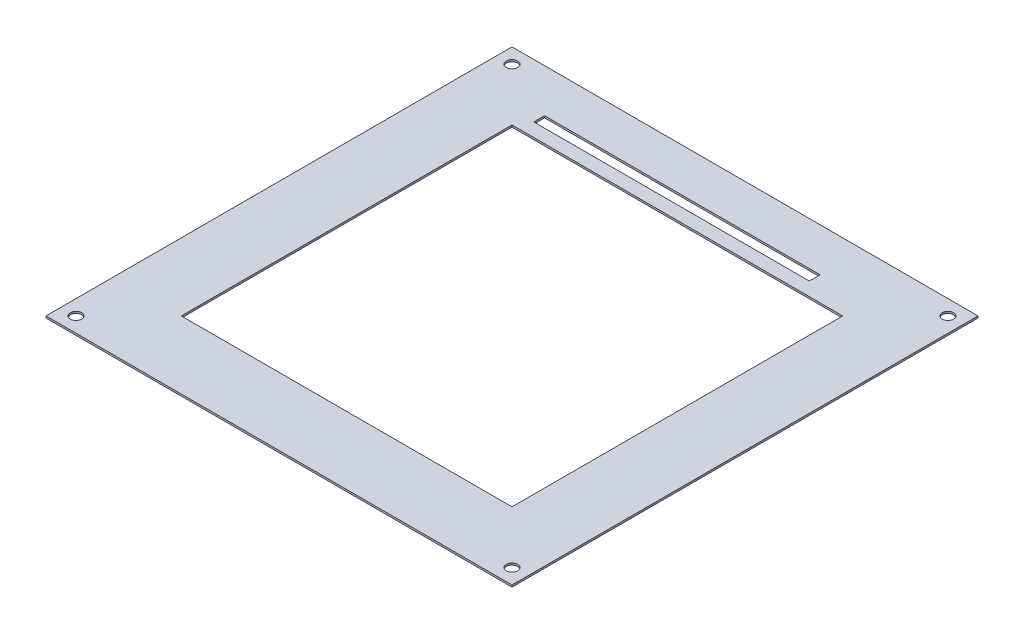
ISO-10303-21;
HEADER;
FILE_DESCRIPTION(('STEP AP214'),'2;1');
FILE_NAME('part.step','',(''),(''),'','','');
FILE_SCHEMA(('AUTOMOTIVE_DESIGN { 1 0 10303 214 1 1 1 1 }'));
ENDSEC;
DATA;
#1=APPLICATION_CONTEXT('core data for automotive mechanical design processes');
#2=APPLICATION_PROTOCOL_DEFINITION('international standard','automotive_design',2000,#1);
#3=PRODUCT_CONTEXT('',#1,'mechanical');
#4=PRODUCT('Part','Part','',(#3));
#5=PRODUCT_RELATED_PRODUCT_CATEGORY('part','',(#4));
#6=PRODUCT_DEFINITION_FORMATION('','',#4);
#7=PRODUCT_DEFINITION_CONTEXT('part definition',#1,'design');
#8=PRODUCT_DEFINITION('design','',#6,#7);
#9=PRODUCT_DEFINITION_SHAPE('','',#8);
#10=(LENGTH_UNIT() NAMED_UNIT(*) SI_UNIT(.MILLI.,.METRE.));
#11=(NAMED_UNIT(*) PLANE_ANGLE_UNIT() SI_UNIT($,.RADIAN.));
#12=(NAMED_UNIT(*) SI_UNIT($,.STERADIAN.) SOLID_ANGLE_UNIT());
#13=UNCERTAINTY_MEASURE_WITH_UNIT(LENGTH_MEASURE(1.E-05),#10,'distance_accuracy_value','');
#14=(GEOMETRIC_REPRESENTATION_CONTEXT(3) GLOBAL_UNCERTAINTY_ASSIGNED_CONTEXT((#13)) GLOBAL_UNIT_ASSIGNED_CONTEXT((#10,
#11,#12)) REPRESENTATION_CONTEXT('',''));
#15=CARTESIAN_POINT('',(0.,0.,0.));
#16=DIRECTION('',(0.,0.,1.));
#17=DIRECTION('',(1.,0.,0.));
#18=AXIS2_PLACEMENT_3D('',#15,#16,#17);
#19=CARTESIAN_POINT('',(0.,0.5,0.));
#20=DIRECTION('',(0.,-1.,0.));
#21=DIRECTION('',(0.,0.,-1.));
#22=AXIS2_PLACEMENT_3D('',#19,#20,#21);
#23=PLANE('',#22);
#24=CARTESIAN_POINT('',(120.,0.5,-4.));
#25=DIRECTION('',(0.,1.,0.));
#26=DIRECTION('',(0.,0.,1.));
#27=AXIS2_PLACEMENT_3D('',#24,#25,#26);
#28=CIRCLE('',#27,1.5);
#29=CARTESIAN_POINT('',(120.,0.5,-2.5));
#30=VERTEX_POINT('',#29);
#31=EDGE_CURVE('E332',#30,#30,#28,.T.);
#32=ORIENTED_EDGE('',*,*,#31,.F.);
#33=EDGE_LOOP('',(#32));
#34=FACE_BOUND('',#33,.T.);
#35=CARTESIAN_POINT('',(4.,0.5,-120.));
#36=DIRECTION('',(0.,1.,0.));
#37=DIRECTION('',(0.,0.,1.));
#38=AXIS2_PLACEMENT_3D('',#35,#36,#37);
#39=CIRCLE('',#38,1.5);
#40=CARTESIAN_POINT('',(4.,0.5,-118.5));
#41=VERTEX_POINT('',#40);
#42=EDGE_CURVE('E155',#41,#41,#39,.T.);
#43=ORIENTED_EDGE('',*,*,#42,.F.);
#44=EDGE_LOOP('',(#43));
#45=FACE_BOUND('',#44,.T.);
#46=DIRECTION('',(0.,0.,1.));
#47=VECTOR('',#46,1.);
#48=CARTESIAN_POINT('',(18.,0.5,-106.));
#49=LINE('',#48,#47);
#50=CARTESIAN_POINT('',(18.,0.5,-106.));
#51=VERTEX_POINT('',#50);
#52=CARTESIAN_POINT('',(18.,0.5,-18.));
#53=VERTEX_POINT('',#52);
#54=EDGE_CURVE('E165',#51,#53,#49,.T.);
#55=ORIENTED_EDGE('',*,*,#54,.F.);
#56=DIRECTION('',(-1.,0.,0.));
#57=VECTOR('',#56,1.);
#58=CARTESIAN_POINT('',(18.,0.5,-106.));
#59=LINE('',#58,#57);
#60=CARTESIAN_POINT('',(106.,0.5,-106.));
#61=VERTEX_POINT('',#60);
#62=EDGE_CURVE('E173',#61,#51,#59,.T.);
#63=ORIENTED_EDGE('',*,*,#62,.F.);
#64=DIRECTION('',(0.,0.,-1.));
#65=VECTOR('',#64,1.);
#66=CARTESIAN_POINT('',(106.,0.5,-106.));
#67=LINE('',#66,#65);
#68=CARTESIAN_POINT('',(106.,0.5,-18.));
#69=VERTEX_POINT('',#68);
#70=EDGE_CURVE('E170',#69,#61,#67,.T.);
#71=ORIENTED_EDGE('',*,*,#70,.F.);
#72=DIRECTION('',(1.,0.,0.));
#73=VECTOR('',#72,1.);
#74=CARTESIAN_POINT('',(18.,0.5,-18.));
#75=LINE('',#74,#73);
#76=EDGE_CURVE('E167',#53,#69,#75,.T.);
#77=ORIENTED_EDGE('',*,*,#76,.F.);
#78=EDGE_LOOP('',(#55,#63,#71,#77));
#79=FACE_BOUND('',#78,.T.);
#80=DIRECTION('',(0.,0.,1.));
#81=VECTOR('',#80,1.);
#82=CARTESIAN_POINT('',(0.,0.5,0.));
#83=LINE('',#82,#81);
#84=CARTESIAN_POINT('',(0.,0.5,-124.));
#85=VERTEX_POINT('',#84);
#86=CARTESIAN_POINT('',(0.,0.5,0.));
#87=VERTEX_POINT('',#86);
#88=EDGE_CURVE('E196',#85,#87,#83,.T.);
#89=ORIENTED_EDGE('',*,*,#88,.T.);
#90=DIRECTION('',(1.,0.,0.));
#91=VECTOR('',#90,1.);
#92=CARTESIAN_POINT('',(0.,0.5,0.));
#93=LINE('',#92,#91);
#94=CARTESIAN_POINT('',(124.,0.5,0.));
#95=VERTEX_POINT('',#94);
#96=EDGE_CURVE('E199',#87,#95,#93,.T.);
#97=ORIENTED_EDGE('',*,*,#96,.T.);
#98=DIRECTION('',(0.,0.,-1.));
#99=VECTOR('',#98,1.);
#100=CARTESIAN_POINT('',(124.,0.5,0.));
#101=LINE('',#100,#99);
#102=CARTESIAN_POINT('',(124.,0.5,-124.));
#103=VERTEX_POINT('',#102);
#104=EDGE_CURVE('E202',#95,#103,#101,.T.);
#105=ORIENTED_EDGE('',*,*,#104,.T.);
#106=DIRECTION('',(-1.,0.,0.));
#107=VECTOR('',#106,1.);
#108=CARTESIAN_POINT('',(0.,0.5,-124.));
#109=LINE('',#108,#107);
#110=EDGE_CURVE('E204',#103,#85,#109,.T.);
#111=ORIENTED_EDGE('',*,*,#110,.T.);
#112=EDGE_LOOP('',(#89,#97,#105,#111));
#113=FACE_BOUND('',#112,.T.);
#114=DIRECTION('',(0.,0.,1.));
#115=VECTOR('',#114,1.);
#116=CARTESIAN_POINT('',(20.1898829633925,0.5,-112.467326066186));
#117=LINE('',#116,#115);
#118=CARTESIAN_POINT('',(20.1898829633925,0.5,-112.467326066186));
#119=VERTEX_POINT('',#118);
#120=CARTESIAN_POINT('',(20.1898829633925,0.5,-109.596676405698));
#121=VERTEX_POINT('',#120);
#122=EDGE_CURVE('E126',#119,#121,#117,.T.);
#123=ORIENTED_EDGE('',*,*,#122,.F.);
#124=DIRECTION('',(-1.,0.,0.));
#125=VECTOR('',#124,1.);
#126=CARTESIAN_POINT('',(20.1898829633925,0.5,-112.467326066186));
#127=LINE('',#126,#125);
#128=CARTESIAN_POINT('',(93.5219333813082,0.5,-112.467326066186));
#129=VERTEX_POINT('',#128);
#130=EDGE_CURVE('E149',#129,#119,#127,.T.);
#131=ORIENTED_EDGE('',*,*,#130,.F.);
#132=DIRECTION('',(0.,0.,-1.));
#133=VECTOR('',#132,1.);
#134=CARTESIAN_POINT('',(93.5219333813082,0.5,-112.467326066186));
#135=LINE('',#134,#133);
#136=CARTESIAN_POINT('',(93.5219333813082,0.5,-109.596676405698));
#137=VERTEX_POINT('',#136);
#138=EDGE_CURVE('E147',#137,#129,#135,.T.);
#139=ORIENTED_EDGE('',*,*,#138,.F.);
#140=DIRECTION('',(1.,0.,0.));
#141=VECTOR('',#140,1.);
#142=CARTESIAN_POINT('',(20.1898829633925,0.5,-109.596676405698));
#143=LINE('',#142,#141);
#144=EDGE_CURVE('E134',#121,#137,#143,.T.);
#145=ORIENTED_EDGE('',*,*,#144,.F.);
#146=EDGE_LOOP('',(#123,#131,#139,#145));
#147=FACE_BOUND('',#146,.T.);
#148=CARTESIAN_POINT('',(120.,0.5,-120.));
#149=DIRECTION('',(0.,1.,0.));
#150=DIRECTION('',(0.,0.,1.));
#151=AXIS2_PLACEMENT_3D('',#148,#149,#150);
#152=CIRCLE('',#151,1.5);
#153=CARTESIAN_POINT('',(120.,0.5,-118.5));
#154=VERTEX_POINT('',#153);
#155=EDGE_CURVE('E338',#154,#154,#152,.T.);
#156=ORIENTED_EDGE('',*,*,#155,.F.);
#157=EDGE_LOOP('',(#156));
#158=FACE_BOUND('',#157,.T.);
#159=CARTESIAN_POINT('',(4.,0.5,-4.));
#160=DIRECTION('',(0.,1.,0.));
#161=DIRECTION('',(0.,0.,1.));
#162=AXIS2_PLACEMENT_3D('',#159,#160,#161);
#163=CIRCLE('',#162,1.5);
#164=CARTESIAN_POINT('',(4.,0.5,-2.5));
#165=VERTEX_POINT('',#164);
#166=EDGE_CURVE('E323',#165,#165,#163,.T.);
#167=ORIENTED_EDGE('',*,*,#166,.F.);
#168=EDGE_LOOP('',(#167));
#169=FACE_BOUND('',#168,.T.);
#170=ADVANCED_FACE('F37',(#34,#45,#79,#113,#147,#158,#169),#23,.F.);
#171=CARTESIAN_POINT('',(0.,0.,0.));
#172=DIRECTION('',(0.,-1.,0.));
#173=DIRECTION('',(0.,0.,-1.));
#174=AXIS2_PLACEMENT_3D('',#171,#172,#173);
#175=PLANE('',#174);
#176=CARTESIAN_POINT('',(120.,0.,-4.));
#177=DIRECTION('',(0.,1.,0.));
#178=DIRECTION('',(0.,0.,1.));
#179=AXIS2_PLACEMENT_3D('',#176,#177,#178);
#180=CIRCLE('',#179,1.5);
#181=CARTESIAN_POINT('',(120.,0.,-2.5));
#182=VERTEX_POINT('',#181);
#183=EDGE_CURVE('E329',#182,#182,#180,.T.);
#184=ORIENTED_EDGE('',*,*,#183,.T.);
#185=EDGE_LOOP('',(#184));
#186=FACE_BOUND('',#185,.T.);
#187=CARTESIAN_POINT('',(4.,0.,-120.));
#188=DIRECTION('',(0.,1.,0.));
#189=DIRECTION('',(0.,0.,1.));
#190=AXIS2_PLACEMENT_3D('',#187,#188,#189);
#191=CIRCLE('',#190,1.5);
#192=CARTESIAN_POINT('',(4.,0.,-118.5));
#193=VERTEX_POINT('',#192);
#194=EDGE_CURVE('E341',#193,#193,#191,.T.);
#195=ORIENTED_EDGE('',*,*,#194,.T.);
#196=EDGE_LOOP('',(#195));
#197=FACE_BOUND('',#196,.T.);
#198=DIRECTION('',(-1.,0.,0.));
#199=VECTOR('',#198,1.);
#200=CARTESIAN_POINT('',(18.,0.,-106.));
#201=LINE('',#200,#199);
#202=CARTESIAN_POINT('',(106.,0.,-106.));
#203=VERTEX_POINT('',#202);
#204=CARTESIAN_POINT('',(18.,0.,-106.));
#205=VERTEX_POINT('',#204);
#206=EDGE_CURVE('E168',#203,#205,#201,.T.);
#207=ORIENTED_EDGE('',*,*,#206,.T.);
#208=DIRECTION('',(0.,0.,1.));
#209=VECTOR('',#208,1.);
#210=CARTESIAN_POINT('',(18.,0.,-106.));
#211=LINE('',#210,#209);
#212=CARTESIAN_POINT('',(18.,0.,-18.));
#213=VERTEX_POINT('',#212);
#214=EDGE_CURVE('E142',#205,#213,#211,.T.);
#215=ORIENTED_EDGE('',*,*,#214,.T.);
#216=DIRECTION('',(1.,0.,0.));
#217=VECTOR('',#216,1.);
#218=CARTESIAN_POINT('',(18.,0.,-18.));
#219=LINE('',#218,#217);
#220=CARTESIAN_POINT('',(106.,0.,-18.));
#221=VERTEX_POINT('',#220);
#222=EDGE_CURVE('E178',#213,#221,#219,.T.);
#223=ORIENTED_EDGE('',*,*,#222,.T.);
#224=DIRECTION('',(0.,0.,-1.));
#225=VECTOR('',#224,1.);
#226=CARTESIAN_POINT('',(106.,0.,-106.));
#227=LINE('',#226,#225);
#228=EDGE_CURVE('E181',#221,#203,#227,.T.);
#229=ORIENTED_EDGE('',*,*,#228,.T.);
#230=EDGE_LOOP('',(#207,#215,#223,#229));
#231=FACE_BOUND('',#230,.T.);
#232=DIRECTION('',(0.,0.,1.));
#233=VECTOR('',#232,1.);
#234=CARTESIAN_POINT('',(0.,0.,0.));
#235=LINE('',#234,#233);
#236=CARTESIAN_POINT('',(0.,0.,-124.));
#237=VERTEX_POINT('',#236);
#238=CARTESIAN_POINT('',(0.,0.,0.));
#239=VERTEX_POINT('',#238);
#240=EDGE_CURVE('E195',#237,#239,#235,.T.);
#241=ORIENTED_EDGE('',*,*,#240,.F.);
#242=DIRECTION('',(-1.,0.,0.));
#243=VECTOR('',#242,1.);
#244=CARTESIAN_POINT('',(0.,0.,-124.));
#245=LINE('',#244,#243);
#246=CARTESIAN_POINT('',(124.,0.,-124.));
#247=VERTEX_POINT('',#246);
#248=EDGE_CURVE('E200',#247,#237,#245,.T.);
#249=ORIENTED_EDGE('',*,*,#248,.F.);
#250=DIRECTION('',(0.,0.,-1.));
#251=VECTOR('',#250,1.);
#252=CARTESIAN_POINT('',(124.,0.,0.));
#253=LINE('',#252,#251);
#254=CARTESIAN_POINT('',(124.,0.,0.));
#255=VERTEX_POINT('',#254);
#256=EDGE_CURVE('E211',#255,#247,#253,.T.);
#257=ORIENTED_EDGE('',*,*,#256,.F.);
#258=DIRECTION('',(1.,0.,0.));
#259=VECTOR('',#258,1.);
#260=CARTESIAN_POINT('',(0.,0.,0.));
#261=LINE('',#260,#259);
#262=EDGE_CURVE('E209',#239,#255,#261,.T.);
#263=ORIENTED_EDGE('',*,*,#262,.F.);
#264=EDGE_LOOP('',(#241,#249,#257,#263));
#265=FACE_BOUND('',#264,.T.);
#266=DIRECTION('',(-1.,0.,0.));
#267=VECTOR('',#266,1.);
#268=CARTESIAN_POINT('',(20.1898829633925,0.,-112.467326066186));
#269=LINE('',#268,#267);
#270=CARTESIAN_POINT('',(93.5219333813082,0.,-112.467326066186));
#271=VERTEX_POINT('',#270);
#272=CARTESIAN_POINT('',(20.1898829633925,0.,-112.467326066186));
#273=VERTEX_POINT('',#272);
#274=EDGE_CURVE('E135',#271,#273,#269,.T.);
#275=ORIENTED_EDGE('',*,*,#274,.T.);
#276=DIRECTION('',(0.,0.,1.));
#277=VECTOR('',#276,1.);
#278=CARTESIAN_POINT('',(20.1898829633925,0.,-112.467326066186));
#279=LINE('',#278,#277);
#280=CARTESIAN_POINT('',(20.1898829633925,0.,-109.596676405698));
#281=VERTEX_POINT('',#280);
#282=EDGE_CURVE('E60',#273,#281,#279,.T.);
#283=ORIENTED_EDGE('',*,*,#282,.T.);
#284=DIRECTION('',(1.,0.,0.));
#285=VECTOR('',#284,1.);
#286=CARTESIAN_POINT('',(20.1898829633925,0.,-109.596676405698));
#287=LINE('',#286,#285);
#288=CARTESIAN_POINT('',(93.5219333813082,0.,-109.596676405698));
#289=VERTEX_POINT('',#288);
#290=EDGE_CURVE('E141',#281,#289,#287,.T.);
#291=ORIENTED_EDGE('',*,*,#290,.T.);
#292=DIRECTION('',(0.,0.,-1.));
#293=VECTOR('',#292,1.);
#294=CARTESIAN_POINT('',(93.5219333813082,0.,-112.467326066186));
#295=LINE('',#294,#293);
#296=EDGE_CURVE('E157',#289,#271,#295,.T.);
#297=ORIENTED_EDGE('',*,*,#296,.T.);
#298=EDGE_LOOP('',(#275,#283,#291,#297));
#299=FACE_BOUND('',#298,.T.);
#300=CARTESIAN_POINT('',(120.,0.,-120.));
#301=DIRECTION('',(0.,1.,0.));
#302=DIRECTION('',(0.,0.,1.));
#303=AXIS2_PLACEMENT_3D('',#300,#301,#302);
#304=CIRCLE('',#303,1.5);
#305=CARTESIAN_POINT('',(120.,0.,-118.5));
#306=VERTEX_POINT('',#305);
#307=EDGE_CURVE('E335',#306,#306,#304,.T.);
#308=ORIENTED_EDGE('',*,*,#307,.T.);
#309=EDGE_LOOP('',(#308));
#310=FACE_BOUND('',#309,.T.);
#311=CARTESIAN_POINT('',(4.,0.,-4.));
#312=DIRECTION('',(0.,1.,0.));
#313=DIRECTION('',(0.,0.,1.));
#314=AXIS2_PLACEMENT_3D('',#311,#312,#313);
#315=CIRCLE('',#314,1.5);
#316=CARTESIAN_POINT('',(4.,0.,-2.5));
#317=VERTEX_POINT('',#316);
#318=EDGE_CURVE('E326',#317,#317,#315,.T.);
#319=ORIENTED_EDGE('',*,*,#318,.T.);
#320=EDGE_LOOP('',(#319));
#321=FACE_BOUND('',#320,.T.);
#322=ADVANCED_FACE('F229',(#186,#197,#231,#265,#299,#310,#321),#175,.T.);
#323=CARTESIAN_POINT('',(0.,0.5,0.));
#324=DIRECTION('',(1.,0.,0.));
#325=DIRECTION('',(0.,0.,-1.));
#326=AXIS2_PLACEMENT_3D('',#323,#324,#325);
#327=PLANE('',#326);
#328=ORIENTED_EDGE('',*,*,#240,.T.);
#329=DIRECTION('',(0.,-1.,0.));
#330=VECTOR('',#329,1.);
#331=CARTESIAN_POINT('',(0.,0.5,0.));
#332=LINE('',#331,#330);
#333=EDGE_CURVE('E11',#87,#239,#332,.T.);
#334=ORIENTED_EDGE('',*,*,#333,.F.);
#335=ORIENTED_EDGE('',*,*,#88,.F.);
#336=DIRECTION('',(0.,-1.,0.));
#337=VECTOR('',#336,1.);
#338=CARTESIAN_POINT('',(0.,0.5,-124.));
#339=LINE('',#338,#337);
#340=EDGE_CURVE('E206',#85,#237,#339,.T.);
#341=ORIENTED_EDGE('',*,*,#340,.T.);
#342=EDGE_LOOP('',(#328,#334,#335,#341));
#343=FACE_BOUND('',#342,.T.);
#344=ADVANCED_FACE('F39',(#343),#327,.F.);
#345=CARTESIAN_POINT('',(0.,0.5,0.));
#346=DIRECTION('',(0.,0.,-1.));
#347=DIRECTION('',(-1.,0.,0.));
#348=AXIS2_PLACEMENT_3D('',#345,#346,#347);
#349=PLANE('',#348);
#350=ORIENTED_EDGE('',*,*,#262,.T.);
#351=DIRECTION('',(0.,-1.,0.));
#352=VECTOR('',#351,1.);
#353=CARTESIAN_POINT('',(124.,0.5,0.));
#354=LINE('',#353,#352);
#355=EDGE_CURVE('E45',#95,#255,#354,.T.);
#356=ORIENTED_EDGE('',*,*,#355,.F.);
#357=ORIENTED_EDGE('',*,*,#96,.F.);
#358=ORIENTED_EDGE('',*,*,#333,.T.);
#359=EDGE_LOOP('',(#350,#356,#357,#358));
#360=FACE_BOUND('',#359,.T.);
#361=ADVANCED_FACE('F239',(#360),#349,.F.);
#362=CARTESIAN_POINT('',(124.,0.5,0.));
#363=DIRECTION('',(-1.,0.,0.));
#364=DIRECTION('',(0.,0.,1.));
#365=AXIS2_PLACEMENT_3D('',#362,#363,#364);
#366=PLANE('',#365);
#367=ORIENTED_EDGE('',*,*,#256,.T.);
#368=DIRECTION('',(0.,-1.,0.));
#369=VECTOR('',#368,1.);
#370=CARTESIAN_POINT('',(124.,0.5,-124.));
#371=LINE('',#370,#369);
#372=EDGE_CURVE('E216',#103,#247,#371,.T.);
#373=ORIENTED_EDGE('',*,*,#372,.F.);
#374=ORIENTED_EDGE('',*,*,#104,.F.);
#375=ORIENTED_EDGE('',*,*,#355,.T.);
#376=EDGE_LOOP('',(#367,#373,#374,#375));
#377=FACE_BOUND('',#376,.T.);
#378=ADVANCED_FACE('F223',(#377),#366,.F.);
#379=CARTESIAN_POINT('',(0.,0.5,-124.));
#380=DIRECTION('',(0.,0.,1.));
#381=DIRECTION('',(1.,0.,0.));
#382=AXIS2_PLACEMENT_3D('',#379,#380,#381);
#383=PLANE('',#382);
#384=ORIENTED_EDGE('',*,*,#248,.T.);
#385=ORIENTED_EDGE('',*,*,#340,.F.);
#386=ORIENTED_EDGE('',*,*,#110,.F.);
#387=ORIENTED_EDGE('',*,*,#372,.T.);
#388=EDGE_LOOP('',(#384,#385,#386,#387));
#389=FACE_BOUND('',#388,.T.);
#390=ADVANCED_FACE('F233',(#389),#383,.F.);
#391=CARTESIAN_POINT('',(18.,0.5,-106.));
#392=DIRECTION('',(1.,0.,0.));
#393=DIRECTION('',(0.,0.,-1.));
#394=AXIS2_PLACEMENT_3D('',#391,#392,#393);
#395=PLANE('',#394);
#396=ORIENTED_EDGE('',*,*,#214,.F.);
#397=DIRECTION('',(0.,-1.,0.));
#398=VECTOR('',#397,1.);
#399=CARTESIAN_POINT('',(18.,0.5,-106.));
#400=LINE('',#399,#398);
#401=EDGE_CURVE('E175',#51,#205,#400,.T.);
#402=ORIENTED_EDGE('',*,*,#401,.F.);
#403=ORIENTED_EDGE('',*,*,#54,.T.);
#404=DIRECTION('',(0.,-1.,0.));
#405=VECTOR('',#404,1.);
#406=CARTESIAN_POINT('',(18.,0.5,-18.));
#407=LINE('',#406,#405);
#408=EDGE_CURVE('E192',#53,#213,#407,.T.);
#409=ORIENTED_EDGE('',*,*,#408,.T.);
#410=EDGE_LOOP('',(#396,#402,#403,#409));
#411=FACE_BOUND('',#410,.T.);
#412=ADVANCED_FACE('F257',(#411),#395,.T.);
#413=CARTESIAN_POINT('',(18.,0.5,-18.));
#414=DIRECTION('',(0.,0.,-1.));
#415=DIRECTION('',(-1.,0.,0.));
#416=AXIS2_PLACEMENT_3D('',#413,#414,#415);
#417=PLANE('',#416);
#418=ORIENTED_EDGE('',*,*,#222,.F.);
#419=ORIENTED_EDGE('',*,*,#408,.F.);
#420=ORIENTED_EDGE('',*,*,#76,.T.);
#421=DIRECTION('',(0.,-1.,0.));
#422=VECTOR('',#421,1.);
#423=CARTESIAN_POINT('',(106.,0.5,-18.));
#424=LINE('',#423,#422);
#425=EDGE_CURVE('E190',#69,#221,#424,.T.);
#426=ORIENTED_EDGE('',*,*,#425,.T.);
#427=EDGE_LOOP('',(#418,#419,#420,#426));
#428=FACE_BOUND('',#427,.T.);
#429=ADVANCED_FACE('F264',(#428),#417,.T.);
#430=CARTESIAN_POINT('',(106.,0.5,-106.));
#431=DIRECTION('',(-1.,0.,0.));
#432=DIRECTION('',(0.,0.,1.));
#433=AXIS2_PLACEMENT_3D('',#430,#431,#432);
#434=PLANE('',#433);
#435=ORIENTED_EDGE('',*,*,#228,.F.);
#436=ORIENTED_EDGE('',*,*,#425,.F.);
#437=ORIENTED_EDGE('',*,*,#70,.T.);
#438=DIRECTION('',(0.,-1.,0.));
#439=VECTOR('',#438,1.);
#440=CARTESIAN_POINT('',(106.,0.5,-106.));
#441=LINE('',#440,#439);
#442=EDGE_CURVE('E188',#61,#203,#441,.T.);
#443=ORIENTED_EDGE('',*,*,#442,.T.);
#444=EDGE_LOOP('',(#435,#436,#437,#443));
#445=FACE_BOUND('',#444,.T.);
#446=ADVANCED_FACE('F269',(#445),#434,.T.);
#447=CARTESIAN_POINT('',(18.,0.5,-106.));
#448=DIRECTION('',(0.,0.,1.));
#449=DIRECTION('',(1.,0.,0.));
#450=AXIS2_PLACEMENT_3D('',#447,#448,#449);
#451=PLANE('',#450);
#452=ORIENTED_EDGE('',*,*,#206,.F.);
#453=ORIENTED_EDGE('',*,*,#442,.F.);
#454=ORIENTED_EDGE('',*,*,#62,.T.);
#455=ORIENTED_EDGE('',*,*,#401,.T.);
#456=EDGE_LOOP('',(#452,#453,#454,#455));
#457=FACE_BOUND('',#456,.T.);
#458=ADVANCED_FACE('F277',(#457),#451,.T.);
#459=CARTESIAN_POINT('',(20.1898829633925,0.5,-112.467326066186));
#460=DIRECTION('',(1.,0.,0.));
#461=DIRECTION('',(0.,0.,-1.));
#462=AXIS2_PLACEMENT_3D('',#459,#460,#461);
#463=PLANE('',#462);
#464=ORIENTED_EDGE('',*,*,#282,.F.);
#465=DIRECTION('',(0.,-1.,0.));
#466=VECTOR('',#465,1.);
#467=CARTESIAN_POINT('',(20.1898829633925,0.5,-112.467326066186));
#468=LINE('',#467,#466);
#469=EDGE_CURVE('E130',#119,#273,#468,.T.);
#470=ORIENTED_EDGE('',*,*,#469,.F.);
#471=ORIENTED_EDGE('',*,*,#122,.T.);
#472=DIRECTION('',(0.,-1.,0.));
#473=VECTOR('',#472,1.);
#474=CARTESIAN_POINT('',(20.1898829633925,0.5,-109.596676405698));
#475=LINE('',#474,#473);
#476=EDGE_CURVE('E129',#121,#281,#475,.T.);
#477=ORIENTED_EDGE('',*,*,#476,.T.);
#478=EDGE_LOOP('',(#464,#470,#471,#477));
#479=FACE_BOUND('',#478,.T.);
#480=ADVANCED_FACE('F128',(#479),#463,.T.);
#481=CARTESIAN_POINT('',(20.1898829633925,0.5,-109.596676405698));
#482=DIRECTION('',(0.,0.,-1.));
#483=DIRECTION('',(-1.,0.,0.));
#484=AXIS2_PLACEMENT_3D('',#481,#482,#483);
#485=PLANE('',#484);
#486=ORIENTED_EDGE('',*,*,#290,.F.);
#487=ORIENTED_EDGE('',*,*,#476,.F.);
#488=ORIENTED_EDGE('',*,*,#144,.T.);
#489=DIRECTION('',(0.,-1.,0.));
#490=VECTOR('',#489,1.);
#491=CARTESIAN_POINT('',(93.5219333813082,0.5,-109.596676405698));
#492=LINE('',#491,#490);
#493=EDGE_CURVE('E143',#137,#289,#492,.T.);
#494=ORIENTED_EDGE('',*,*,#493,.T.);
#495=EDGE_LOOP('',(#486,#487,#488,#494));
#496=FACE_BOUND('',#495,.T.);
#497=ADVANCED_FACE('F138',(#496),#485,.T.);
#498=CARTESIAN_POINT('',(93.5219333813082,0.5,-112.467326066186));
#499=DIRECTION('',(-1.,0.,0.));
#500=DIRECTION('',(0.,0.,1.));
#501=AXIS2_PLACEMENT_3D('',#498,#499,#500);
#502=PLANE('',#501);
#503=ORIENTED_EDGE('',*,*,#296,.F.);
#504=ORIENTED_EDGE('',*,*,#493,.F.);
#505=ORIENTED_EDGE('',*,*,#138,.T.);
#506=DIRECTION('',(0.,-1.,0.));
#507=VECTOR('',#506,1.);
#508=CARTESIAN_POINT('',(93.5219333813082,0.5,-112.467326066186));
#509=LINE('',#508,#507);
#510=EDGE_CURVE('E52',#129,#271,#509,.T.);
#511=ORIENTED_EDGE('',*,*,#510,.T.);
#512=EDGE_LOOP('',(#503,#504,#505,#511));
#513=FACE_BOUND('',#512,.T.);
#514=ADVANCED_FACE('F296',(#513),#502,.T.);
#515=CARTESIAN_POINT('',(20.1898829633925,0.5,-112.467326066186));
#516=DIRECTION('',(0.,0.,1.));
#517=DIRECTION('',(1.,0.,0.));
#518=AXIS2_PLACEMENT_3D('',#515,#516,#517);
#519=PLANE('',#518);
#520=ORIENTED_EDGE('',*,*,#274,.F.);
#521=ORIENTED_EDGE('',*,*,#510,.F.);
#522=ORIENTED_EDGE('',*,*,#130,.T.);
#523=ORIENTED_EDGE('',*,*,#469,.T.);
#524=EDGE_LOOP('',(#520,#521,#522,#523));
#525=FACE_BOUND('',#524,.T.);
#526=ADVANCED_FACE('F299',(#525),#519,.T.);
#527=CARTESIAN_POINT('',(4.,0.5,-120.));
#528=DIRECTION('',(0.,-1.,0.));
#529=DIRECTION('',(0.,0.,-1.));
#530=AXIS2_PLACEMENT_3D('',#527,#528,#529);
#531=CYLINDRICAL_SURFACE('',#530,1.5);
#532=ORIENTED_EDGE('',*,*,#42,.T.);
#533=EDGE_LOOP('',(#532));
#534=FACE_BOUND('',#533,.T.);
#535=ORIENTED_EDGE('',*,*,#194,.F.);
#536=EDGE_LOOP('',(#535));
#537=FACE_BOUND('',#536,.T.);
#538=ADVANCED_FACE('F303',(#534,#537),#531,.F.);
#539=CARTESIAN_POINT('',(120.,0.5,-120.));
#540=DIRECTION('',(0.,-1.,0.));
#541=DIRECTION('',(0.,0.,-1.));
#542=AXIS2_PLACEMENT_3D('',#539,#540,#541);
#543=CYLINDRICAL_SURFACE('',#542,1.5);
#544=ORIENTED_EDGE('',*,*,#155,.T.);
#545=EDGE_LOOP('',(#544));
#546=FACE_BOUND('',#545,.T.);
#547=ORIENTED_EDGE('',*,*,#307,.F.);
#548=EDGE_LOOP('',(#547));
#549=FACE_BOUND('',#548,.T.);
#550=ADVANCED_FACE('F306',(#546,#549),#543,.F.);
#551=CARTESIAN_POINT('',(120.,0.5,-4.));
#552=DIRECTION('',(0.,-1.,0.));
#553=DIRECTION('',(0.,0.,-1.));
#554=AXIS2_PLACEMENT_3D('',#551,#552,#553);
#555=CYLINDRICAL_SURFACE('',#554,1.5);
#556=ORIENTED_EDGE('',*,*,#31,.T.);
#557=EDGE_LOOP('',(#556));
#558=FACE_BOUND('',#557,.T.);
#559=ORIENTED_EDGE('',*,*,#183,.F.);
#560=EDGE_LOOP('',(#559));
#561=FACE_BOUND('',#560,.T.);
#562=ADVANCED_FACE('F310',(#558,#561),#555,.F.);
#563=CARTESIAN_POINT('',(4.,0.5,-4.));
#564=DIRECTION('',(0.,-1.,0.));
#565=DIRECTION('',(0.,0.,-1.));
#566=AXIS2_PLACEMENT_3D('',#563,#564,#565);
#567=CYLINDRICAL_SURFACE('',#566,1.5);
#568=ORIENTED_EDGE('',*,*,#166,.T.);
#569=EDGE_LOOP('',(#568));
#570=FACE_BOUND('',#569,.T.);
#571=ORIENTED_EDGE('',*,*,#318,.F.);
#572=EDGE_LOOP('',(#571));
#573=FACE_BOUND('',#572,.T.);
#574=ADVANCED_FACE('F314',(#570,#573),#567,.F.);
#575=CLOSED_SHELL('',(#170,#322,#344,#361,#378,#390,#412,#429,#446,#458,#480,#497,#514,#526,
#538,#550,#562,#574));
#576=MANIFOLD_SOLID_BREP('B2',#575);
#577=ADVANCED_BREP_SHAPE_REPRESENTATION('',(#18,#576),#14);
#578=SHAPE_DEFINITION_REPRESENTATION(#9,#577);
ENDSEC;
END-ISO-10303-21;
